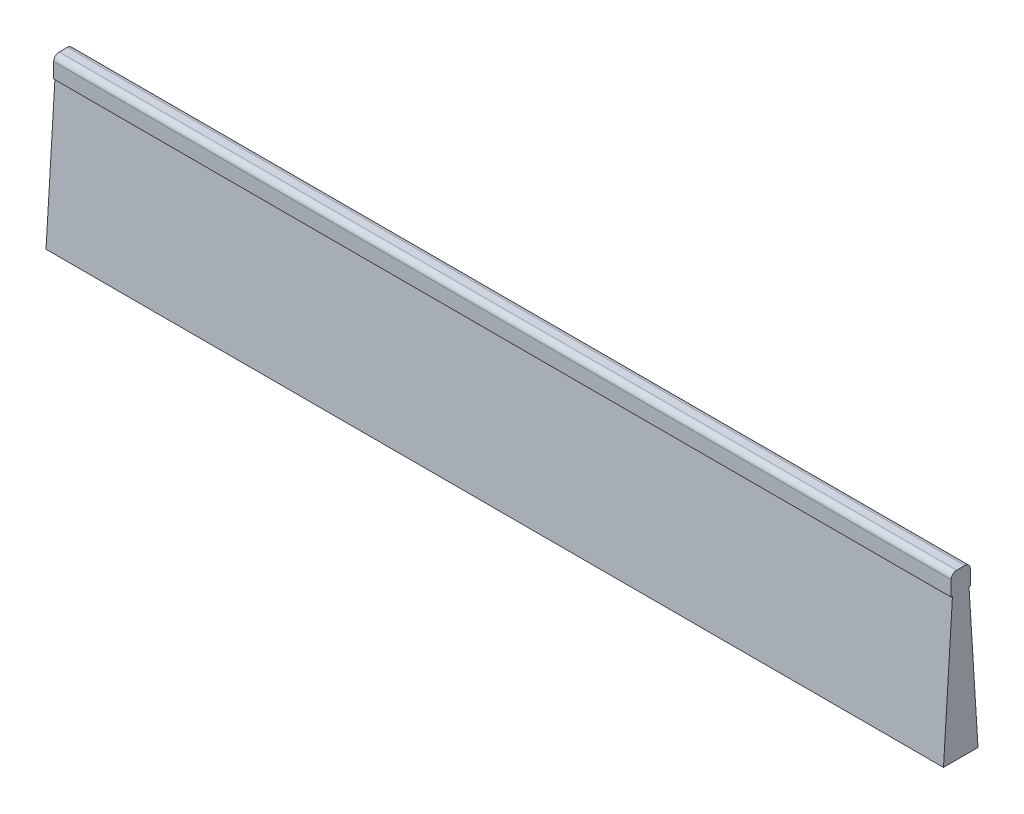
ISO-10303-21;
HEADER;
FILE_DESCRIPTION(('STEP AP214'),'2;1');
FILE_NAME('part.step','',(''),(''),'','','');
FILE_SCHEMA(('AUTOMOTIVE_DESIGN { 1 0 10303 214 1 1 1 1 }'));
ENDSEC;
DATA;
#1=APPLICATION_CONTEXT('core data for automotive mechanical design processes');
#2=APPLICATION_PROTOCOL_DEFINITION('international standard','automotive_design',2000,#1);
#3=PRODUCT_CONTEXT('',#1,'mechanical');
#4=PRODUCT('Part','Part','',(#3));
#5=PRODUCT_RELATED_PRODUCT_CATEGORY('part','',(#4));
#6=PRODUCT_DEFINITION_FORMATION('','',#4);
#7=PRODUCT_DEFINITION_CONTEXT('part definition',#1,'design');
#8=PRODUCT_DEFINITION('design','',#6,#7);
#9=PRODUCT_DEFINITION_SHAPE('','',#8);
#10=(LENGTH_UNIT() NAMED_UNIT(*) SI_UNIT(.MILLI.,.METRE.));
#11=(NAMED_UNIT(*) PLANE_ANGLE_UNIT() SI_UNIT($,.RADIAN.));
#12=(NAMED_UNIT(*) SI_UNIT($,.STERADIAN.) SOLID_ANGLE_UNIT());
#13=UNCERTAINTY_MEASURE_WITH_UNIT(LENGTH_MEASURE(1.E-05),#10,'distance_accuracy_value','');
#14=(GEOMETRIC_REPRESENTATION_CONTEXT(3) GLOBAL_UNCERTAINTY_ASSIGNED_CONTEXT((#13)) GLOBAL_UNIT_ASSIGNED_CONTEXT((#10,
#11,#12)) REPRESENTATION_CONTEXT('',''));
#15=CARTESIAN_POINT('',(0.,0.,0.));
#16=DIRECTION('',(0.,0.,1.));
#17=DIRECTION('',(1.,0.,0.));
#18=AXIS2_PLACEMENT_3D('',#15,#16,#17);
#19=CARTESIAN_POINT('',(61.9125,0.,-1.3208));
#20=DIRECTION('',(0.,0.,1.));
#21=DIRECTION('',(0.,-1.,0.));
#22=AXIS2_PLACEMENT_3D('',#19,#20,#21);
#23=PLANE('',#22);
#24=DIRECTION('',(0.,1.,0.));
#25=VECTOR('',#24,1.);
#26=CARTESIAN_POINT('',(-61.9125,0.,-1.32080000000001));
#27=LINE('',#26,#25);
#28=CARTESIAN_POINT('',(-61.9125,-2.8448,-1.32080000000001));
#29=VERTEX_POINT('',#28);
#30=CARTESIAN_POINT('',(-61.9125,-0.761999999999999,-1.32080000000001));
#31=VERTEX_POINT('',#30);
#32=EDGE_CURVE('E162',#29,#31,#27,.T.);
#33=ORIENTED_EDGE('',*,*,#32,.T.);
#34=DIRECTION('',(-1.,0.,0.));
#35=VECTOR('',#34,1.);
#36=CARTESIAN_POINT('',(61.9125,-0.761999999999999,-1.3208));
#37=LINE('',#36,#35);
#38=CARTESIAN_POINT('',(61.9125,-0.761999999999999,-1.3208));
#39=VERTEX_POINT('',#38);
#40=EDGE_CURVE('E11',#31,#39,#37,.F.);
#41=ORIENTED_EDGE('',*,*,#40,.T.);
#42=DIRECTION('',(0.,1.,0.));
#43=VECTOR('',#42,1.);
#44=CARTESIAN_POINT('',(61.9125,0.,-1.3208));
#45=LINE('',#44,#43);
#46=CARTESIAN_POINT('',(61.9125,-2.8448,-1.3208));
#47=VERTEX_POINT('',#46);
#48=EDGE_CURVE('E185',#47,#39,#45,.T.);
#49=ORIENTED_EDGE('',*,*,#48,.F.);
#50=DIRECTION('',(-1.,0.,0.));
#51=VECTOR('',#50,1.);
#52=CARTESIAN_POINT('',(61.9125,-2.8448,-1.3208));
#53=LINE('',#52,#51);
#54=EDGE_CURVE('E161',#47,#29,#53,.T.);
#55=ORIENTED_EDGE('',*,*,#54,.T.);
#56=EDGE_LOOP('',(#33,#41,#49,#55));
#57=FACE_BOUND('',#56,.T.);
#58=ADVANCED_FACE('F38',(#57),#23,.F.);
#59=CARTESIAN_POINT('',(61.9125,0.,1.32080000000001));
#60=DIRECTION('',(0.,-1.,0.));
#61=DIRECTION('',(0.,0.,-1.));
#62=AXIS2_PLACEMENT_3D('',#59,#60,#61);
#63=PLANE('',#62);
#64=DIRECTION('',(0.,0.,1.));
#65=VECTOR('',#64,1.);
#66=CARTESIAN_POINT('',(-61.9125,0.,1.3208));
#67=LINE('',#66,#65);
#68=CARTESIAN_POINT('',(-61.9125,0.,-0.558800000000012));
#69=VERTEX_POINT('',#68);
#70=CARTESIAN_POINT('',(-61.9125,0.,0.558799999999998));
#71=VERTEX_POINT('',#70);
#72=EDGE_CURVE('E165',#69,#71,#67,.T.);
#73=ORIENTED_EDGE('',*,*,#72,.T.);
#74=DIRECTION('',(-1.,0.,0.));
#75=VECTOR('',#74,1.);
#76=CARTESIAN_POINT('',(61.9125,0.,0.558799999999998));
#77=LINE('',#76,#75);
#78=CARTESIAN_POINT('',(61.9125,0.,0.558799999999998));
#79=VERTEX_POINT('',#78);
#80=EDGE_CURVE('E60',#71,#79,#77,.F.);
#81=ORIENTED_EDGE('',*,*,#80,.T.);
#82=DIRECTION('',(0.,0.,1.));
#83=VECTOR('',#82,1.);
#84=CARTESIAN_POINT('',(61.9125,0.,1.32080000000001));
#85=LINE('',#84,#83);
#86=CARTESIAN_POINT('',(61.9125,0.,-0.558799999999998));
#87=VERTEX_POINT('',#86);
#88=EDGE_CURVE('E128',#87,#79,#85,.T.);
#89=ORIENTED_EDGE('',*,*,#88,.F.);
#90=DIRECTION('',(-1.,0.,0.));
#91=VECTOR('',#90,1.);
#92=CARTESIAN_POINT('',(61.9125,0.,-0.558799999999998));
#93=LINE('',#92,#91);
#94=EDGE_CURVE('E211',#87,#69,#93,.T.);
#95=ORIENTED_EDGE('',*,*,#94,.T.);
#96=EDGE_LOOP('',(#73,#81,#89,#95));
#97=FACE_BOUND('',#96,.T.);
#98=ADVANCED_FACE('F241',(#97),#63,.F.);
#99=CARTESIAN_POINT('',(61.9125,0.,1.32080000000001));
#100=DIRECTION('',(0.,0.,-1.));
#101=DIRECTION('',(0.,1.,0.));
#102=AXIS2_PLACEMENT_3D('',#99,#100,#101);
#103=PLANE('',#102);
#104=DIRECTION('',(0.,-1.,0.));
#105=VECTOR('',#104,1.);
#106=CARTESIAN_POINT('',(61.9125,0.,1.32080000000001));
#107=LINE('',#106,#105);
#108=CARTESIAN_POINT('',(61.9125,-0.761999999999999,1.3208));
#109=VERTEX_POINT('',#108);
#110=CARTESIAN_POINT('',(61.9125,-2.8448,1.3208));
#111=VERTEX_POINT('',#110);
#112=EDGE_CURVE('E117',#109,#111,#107,.T.);
#113=ORIENTED_EDGE('',*,*,#112,.F.);
#114=DIRECTION('',(-1.,0.,0.));
#115=VECTOR('',#114,1.);
#116=CARTESIAN_POINT('',(61.9125,-0.761999999999999,1.3208));
#117=LINE('',#116,#115);
#118=CARTESIAN_POINT('',(-61.9125,-0.761999999999999,1.3208));
#119=VERTEX_POINT('',#118);
#120=EDGE_CURVE('E138',#109,#119,#117,.T.);
#121=ORIENTED_EDGE('',*,*,#120,.T.);
#122=DIRECTION('',(0.,-1.,0.));
#123=VECTOR('',#122,1.);
#124=CARTESIAN_POINT('',(-61.9125,0.,1.3208));
#125=LINE('',#124,#123);
#126=CARTESIAN_POINT('',(-61.9125,-2.8448,1.3208));
#127=VERTEX_POINT('',#126);
#128=EDGE_CURVE('E134',#119,#127,#125,.T.);
#129=ORIENTED_EDGE('',*,*,#128,.T.);
#130=DIRECTION('',(-1.,0.,0.));
#131=VECTOR('',#130,1.);
#132=CARTESIAN_POINT('',(61.9125,-2.8448,1.3208));
#133=LINE('',#132,#131);
#134=EDGE_CURVE('E131',#111,#127,#133,.T.);
#135=ORIENTED_EDGE('',*,*,#134,.F.);
#136=EDGE_LOOP('',(#113,#121,#129,#135));
#137=FACE_BOUND('',#136,.T.);
#138=ADVANCED_FACE('F132',(#137),#103,.F.);
#139=CARTESIAN_POINT('',(61.9125,-2.8448,1.3208));
#140=DIRECTION('',(0.,1.,0.));
#141=DIRECTION('',(0.,0.,1.));
#142=AXIS2_PLACEMENT_3D('',#139,#140,#141);
#143=PLANE('',#142);
#144=DIRECTION('',(0.,0.,-1.));
#145=VECTOR('',#144,1.);
#146=CARTESIAN_POINT('',(-61.9125,-2.8448,1.3208));
#147=LINE('',#146,#145);
#148=CARTESIAN_POINT('',(-61.9125,-2.8448,1.14299999999999));
#149=VERTEX_POINT('',#148);
#150=EDGE_CURVE('E170',#127,#149,#147,.T.);
#151=ORIENTED_EDGE('',*,*,#150,.T.);
#152=DIRECTION('',(-1.,0.,0.));
#153=VECTOR('',#152,1.);
#154=CARTESIAN_POINT('',(61.9125,-2.8448,1.14300000000001));
#155=LINE('',#154,#153);
#156=CARTESIAN_POINT('',(61.9125,-2.8448,1.14300000000001));
#157=VERTEX_POINT('',#156);
#158=EDGE_CURVE('E139',#157,#149,#155,.T.);
#159=ORIENTED_EDGE('',*,*,#158,.F.);
#160=DIRECTION('',(0.,0.,-1.));
#161=VECTOR('',#160,1.);
#162=CARTESIAN_POINT('',(61.9125,-2.8448,1.3208));
#163=LINE('',#162,#161);
#164=EDGE_CURVE('E121',#111,#157,#163,.T.);
#165=ORIENTED_EDGE('',*,*,#164,.F.);
#166=ORIENTED_EDGE('',*,*,#134,.T.);
#167=EDGE_LOOP('',(#151,#159,#165,#166));
#168=FACE_BOUND('',#167,.T.);
#169=ADVANCED_FACE('F141',(#168),#143,.F.);
#170=CARTESIAN_POINT('',(61.9125,-2.8448,1.14300000000001));
#171=DIRECTION('',(0.,-0.0623782861551804,-0.998052578482889));
#172=DIRECTION('',(0.,0.998052578482889,-0.0623782861551804));
#173=AXIS2_PLACEMENT_3D('',#170,#171,#172);
#174=PLANE('',#173);
#175=DIRECTION('',(0.,-0.998052578482889,0.0623782861551804));
#176=VECTOR('',#175,1.);
#177=CARTESIAN_POINT('',(-61.9125,-2.8448,1.14299999999999));
#178=LINE('',#177,#176);
#179=CARTESIAN_POINT('',(-61.9125,-22.6568,2.38124999999999));
#180=VERTEX_POINT('',#179);
#181=EDGE_CURVE('E173',#149,#180,#178,.T.);
#182=ORIENTED_EDGE('',*,*,#181,.T.);
#183=DIRECTION('',(-1.,0.,0.));
#184=VECTOR('',#183,1.);
#185=CARTESIAN_POINT('',(61.9125,-22.6568,2.38125));
#186=LINE('',#185,#184);
#187=CARTESIAN_POINT('',(61.9125,-22.6568,2.38125));
#188=VERTEX_POINT('',#187);
#189=EDGE_CURVE('E197',#188,#180,#186,.T.);
#190=ORIENTED_EDGE('',*,*,#189,.F.);
#191=DIRECTION('',(0.,-0.998052578482889,0.0623782861551804));
#192=VECTOR('',#191,1.);
#193=CARTESIAN_POINT('',(61.9125,-2.8448,1.14300000000001));
#194=LINE('',#193,#192);
#195=EDGE_CURVE('E145',#157,#188,#194,.T.);
#196=ORIENTED_EDGE('',*,*,#195,.F.);
#197=ORIENTED_EDGE('',*,*,#158,.T.);
#198=EDGE_LOOP('',(#182,#190,#196,#197));
#199=FACE_BOUND('',#198,.T.);
#200=ADVANCED_FACE('F265',(#199),#174,.F.);
#201=CARTESIAN_POINT('',(61.9125,-22.6568,-2.38125));
#202=DIRECTION('',(0.,1.,0.));
#203=DIRECTION('',(0.,0.,1.));
#204=AXIS2_PLACEMENT_3D('',#201,#202,#203);
#205=PLANE('',#204);
#206=DIRECTION('',(0.,0.,-1.));
#207=VECTOR('',#206,1.);
#208=CARTESIAN_POINT('',(-61.9125,-22.6568,-2.38125000000002));
#209=LINE('',#208,#207);
#210=CARTESIAN_POINT('',(-61.9125,-22.6568,-2.38125000000002));
#211=VERTEX_POINT('',#210);
#212=EDGE_CURVE('E176',#180,#211,#209,.T.);
#213=ORIENTED_EDGE('',*,*,#212,.T.);
#214=DIRECTION('',(-1.,0.,0.));
#215=VECTOR('',#214,1.);
#216=CARTESIAN_POINT('',(61.9125,-22.6568,-2.38125));
#217=LINE('',#216,#215);
#218=CARTESIAN_POINT('',(61.9125,-22.6568,-2.38125));
#219=VERTEX_POINT('',#218);
#220=EDGE_CURVE('E193',#219,#211,#217,.T.);
#221=ORIENTED_EDGE('',*,*,#220,.F.);
#222=DIRECTION('',(0.,0.,-1.));
#223=VECTOR('',#222,1.);
#224=CARTESIAN_POINT('',(61.9125,-22.6568,-2.38125));
#225=LINE('',#224,#223);
#226=EDGE_CURVE('E149',#188,#219,#225,.T.);
#227=ORIENTED_EDGE('',*,*,#226,.F.);
#228=ORIENTED_EDGE('',*,*,#189,.T.);
#229=EDGE_LOOP('',(#213,#221,#227,#228));
#230=FACE_BOUND('',#229,.T.);
#231=ADVANCED_FACE('F262',(#230),#205,.F.);
#232=CARTESIAN_POINT('',(61.9125,-2.8448,-1.14299999999999));
#233=DIRECTION('',(0.,-0.0623782861551807,0.998052578482888));
#234=DIRECTION('',(0.,-0.998052578482889,-0.0623782861551807));
#235=AXIS2_PLACEMENT_3D('',#232,#233,#234);
#236=PLANE('',#235);
#237=DIRECTION('',(0.,0.998052578482889,0.0623782861551807));
#238=VECTOR('',#237,1.);
#239=CARTESIAN_POINT('',(-61.9125,-2.8448,-1.14300000000001));
#240=LINE('',#239,#238);
#241=CARTESIAN_POINT('',(-61.9125,-2.8448,-1.14300000000001));
#242=VERTEX_POINT('',#241);
#243=EDGE_CURVE('E179',#211,#242,#240,.T.);
#244=ORIENTED_EDGE('',*,*,#243,.T.);
#245=DIRECTION('',(-1.,0.,0.));
#246=VECTOR('',#245,1.);
#247=CARTESIAN_POINT('',(61.9125,-2.8448,-1.14299999999999));
#248=LINE('',#247,#246);
#249=CARTESIAN_POINT('',(61.9125,-2.8448,-1.14299999999999));
#250=VERTEX_POINT('',#249);
#251=EDGE_CURVE('E189',#250,#242,#248,.T.);
#252=ORIENTED_EDGE('',*,*,#251,.F.);
#253=DIRECTION('',(0.,0.998052578482889,0.0623782861551807));
#254=VECTOR('',#253,1.);
#255=CARTESIAN_POINT('',(61.9125,-2.8448,-1.14299999999999));
#256=LINE('',#255,#254);
#257=EDGE_CURVE('E155',#219,#250,#256,.T.);
#258=ORIENTED_EDGE('',*,*,#257,.F.);
#259=ORIENTED_EDGE('',*,*,#220,.T.);
#260=EDGE_LOOP('',(#244,#252,#258,#259));
#261=FACE_BOUND('',#260,.T.);
#262=ADVANCED_FACE('F257',(#261),#236,.F.);
#263=CARTESIAN_POINT('',(61.9125,-2.8448,-1.3208));
#264=DIRECTION('',(0.,1.,0.));
#265=DIRECTION('',(0.,0.,1.));
#266=AXIS2_PLACEMENT_3D('',#263,#264,#265);
#267=PLANE('',#266);
#268=DIRECTION('',(0.,0.,-1.));
#269=VECTOR('',#268,1.);
#270=CARTESIAN_POINT('',(-61.9125,-2.8448,-1.32080000000001));
#271=LINE('',#270,#269);
#272=EDGE_CURVE('E182',#242,#29,#271,.T.);
#273=ORIENTED_EDGE('',*,*,#272,.T.);
#274=ORIENTED_EDGE('',*,*,#54,.F.);
#275=DIRECTION('',(0.,0.,-1.));
#276=VECTOR('',#275,1.);
#277=CARTESIAN_POINT('',(61.9125,-2.8448,-1.3208));
#278=LINE('',#277,#276);
#279=EDGE_CURVE('E158',#250,#47,#278,.T.);
#280=ORIENTED_EDGE('',*,*,#279,.F.);
#281=ORIENTED_EDGE('',*,*,#251,.T.);
#282=EDGE_LOOP('',(#273,#274,#280,#281));
#283=FACE_BOUND('',#282,.T.);
#284=ADVANCED_FACE('F251',(#283),#267,.F.);
#285=CARTESIAN_POINT('',(61.9125,0.,0.));
#286=DIRECTION('',(-1.,0.,0.));
#287=DIRECTION('',(0.,0.,1.));
#288=AXIS2_PLACEMENT_3D('',#285,#286,#287);
#289=PLANE('',#288);
#290=ORIENTED_EDGE('',*,*,#88,.T.);
#291=CARTESIAN_POINT('',(61.9125,-0.761999999999999,0.558799999999998));
#292=DIRECTION('',(-1.,0.,0.));
#293=DIRECTION('',(0.,0.,1.));
#294=AXIS2_PLACEMENT_3D('',#291,#292,#293);
#295=CIRCLE('',#294,0.762);
#296=EDGE_CURVE('E47',#79,#109,#295,.F.);
#297=ORIENTED_EDGE('',*,*,#296,.T.);
#298=ORIENTED_EDGE('',*,*,#112,.T.);
#299=ORIENTED_EDGE('',*,*,#164,.T.);
#300=ORIENTED_EDGE('',*,*,#195,.T.);
#301=ORIENTED_EDGE('',*,*,#226,.T.);
#302=ORIENTED_EDGE('',*,*,#257,.T.);
#303=ORIENTED_EDGE('',*,*,#279,.T.);
#304=ORIENTED_EDGE('',*,*,#48,.T.);
#305=CARTESIAN_POINT('',(61.9125,-0.761999999999999,-0.558799999999998));
#306=DIRECTION('',(-1.,0.,0.));
#307=DIRECTION('',(0.,0.,1.));
#308=AXIS2_PLACEMENT_3D('',#305,#306,#307);
#309=CIRCLE('',#308,0.762);
#310=EDGE_CURVE('E217',#39,#87,#309,.F.);
#311=ORIENTED_EDGE('',*,*,#310,.T.);
#312=EDGE_LOOP('',(#290,#297,#298,#299,#300,#301,#302,#303,#304,#311));
#313=FACE_BOUND('',#312,.T.);
#314=ADVANCED_FACE('F119',(#313),#289,.F.);
#315=CARTESIAN_POINT('',(-61.9125,0.,0.));
#316=DIRECTION('',(-1.,0.,0.));
#317=DIRECTION('',(0.,0.,1.));
#318=AXIS2_PLACEMENT_3D('',#315,#316,#317);
#319=PLANE('',#318);
#320=ORIENTED_EDGE('',*,*,#128,.F.);
#321=CARTESIAN_POINT('',(-61.9125,-0.761999999999999,0.558799999999998));
#322=DIRECTION('',(-1.,0.,0.));
#323=DIRECTION('',(0.,0.,1.));
#324=AXIS2_PLACEMENT_3D('',#321,#322,#323);
#325=CIRCLE('',#324,0.762);
#326=EDGE_CURVE('E208',#119,#71,#325,.T.);
#327=ORIENTED_EDGE('',*,*,#326,.T.);
#328=ORIENTED_EDGE('',*,*,#72,.F.);
#329=CARTESIAN_POINT('',(-61.9125,-0.761999999999999,-0.558800000000012));
#330=DIRECTION('',(-1.,0.,0.));
#331=DIRECTION('',(0.,0.,1.));
#332=AXIS2_PLACEMENT_3D('',#329,#330,#331);
#333=CIRCLE('',#332,0.762);
#334=EDGE_CURVE('E205',#69,#31,#333,.T.);
#335=ORIENTED_EDGE('',*,*,#334,.T.);
#336=ORIENTED_EDGE('',*,*,#32,.F.);
#337=ORIENTED_EDGE('',*,*,#272,.F.);
#338=ORIENTED_EDGE('',*,*,#243,.F.);
#339=ORIENTED_EDGE('',*,*,#212,.F.);
#340=ORIENTED_EDGE('',*,*,#181,.F.);
#341=ORIENTED_EDGE('',*,*,#150,.F.);
#342=EDGE_LOOP('',(#320,#327,#328,#335,#336,#337,#338,#339,#340,#341));
#343=FACE_BOUND('',#342,.T.);
#344=ADVANCED_FACE('F246',(#343),#319,.T.);
#345=CARTESIAN_POINT('',(61.9125,-0.761999999999999,0.558799999999998));
#346=DIRECTION('',(-1.,0.,0.));
#347=DIRECTION('',(0.,0.,1.));
#348=AXIS2_PLACEMENT_3D('',#345,#346,#347);
#349=CYLINDRICAL_SURFACE('',#348,0.762);
#350=ORIENTED_EDGE('',*,*,#296,.F.);
#351=ORIENTED_EDGE('',*,*,#80,.F.);
#352=ORIENTED_EDGE('',*,*,#326,.F.);
#353=ORIENTED_EDGE('',*,*,#120,.F.);
#354=EDGE_LOOP('',(#350,#351,#352,#353));
#355=FACE_BOUND('',#354,.T.);
#356=ADVANCED_FACE('F267',(#355),#349,.T.);
#357=CARTESIAN_POINT('',(61.9125,-0.761999999999999,-0.558799999999998));
#358=DIRECTION('',(-1.,0.,0.));
#359=DIRECTION('',(0.,0.,1.));
#360=AXIS2_PLACEMENT_3D('',#357,#358,#359);
#361=CYLINDRICAL_SURFACE('',#360,0.762);
#362=ORIENTED_EDGE('',*,*,#310,.F.);
#363=ORIENTED_EDGE('',*,*,#40,.F.);
#364=ORIENTED_EDGE('',*,*,#334,.F.);
#365=ORIENTED_EDGE('',*,*,#94,.F.);
#366=EDGE_LOOP('',(#362,#363,#364,#365));
#367=FACE_BOUND('',#366,.T.);
#368=ADVANCED_FACE('F40',(#367),#361,.T.);
#369=CLOSED_SHELL('',(#58,#98,#138,#169,#200,#231,#262,#284,#314,#344,#356,#368));
#370=MANIFOLD_SOLID_BREP('B2',#369);
#371=ADVANCED_BREP_SHAPE_REPRESENTATION('',(#18,#370),#14);
#372=SHAPE_DEFINITION_REPRESENTATION(#9,#371);
ENDSEC;
END-ISO-10303-21;
